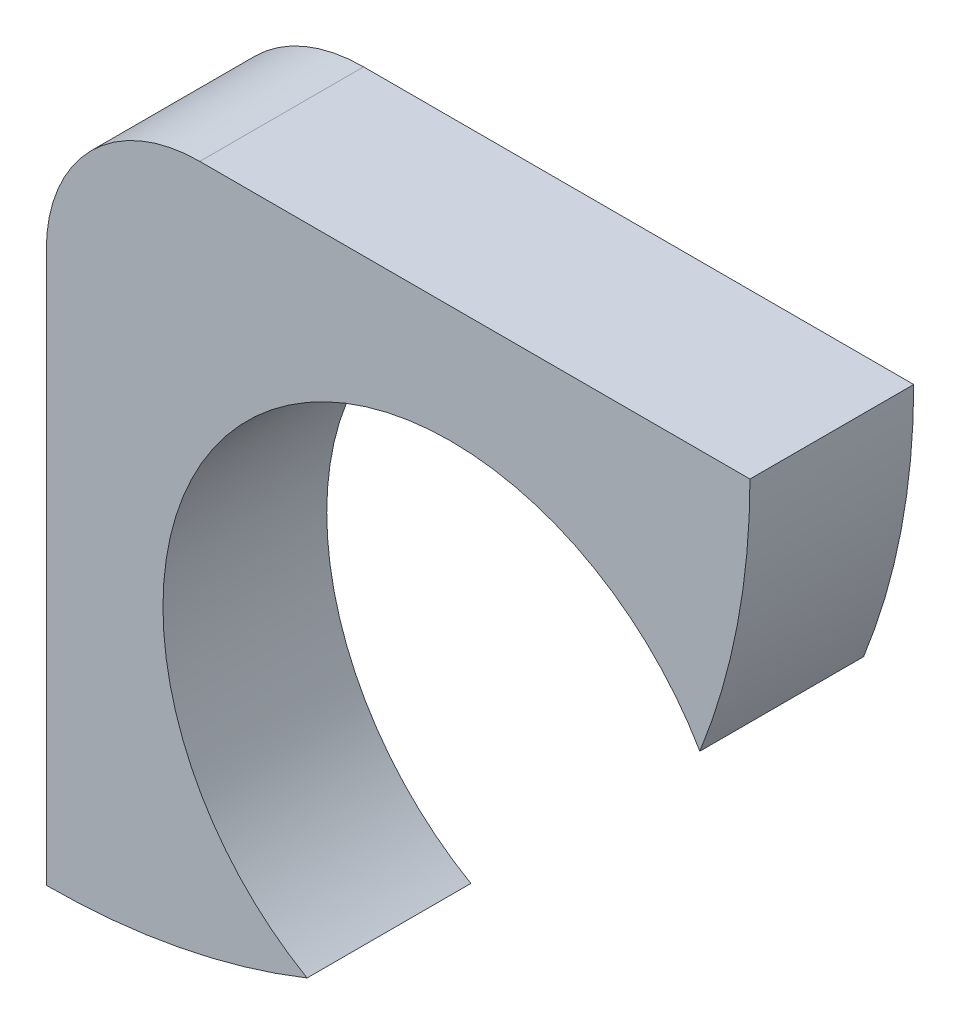
ISO-10303-21;
HEADER;
FILE_DESCRIPTION(('STEP AP214'),'2;1');
FILE_NAME('part.step','',(''),(''),'','','');
FILE_SCHEMA(('AUTOMOTIVE_DESIGN { 1 0 10303 214 1 1 1 1 }'));
ENDSEC;
DATA;
#1=APPLICATION_CONTEXT('core data for automotive mechanical design processes');
#2=APPLICATION_PROTOCOL_DEFINITION('international standard','automotive_design',2000,#1);
#3=PRODUCT_CONTEXT('',#1,'mechanical');
#4=PRODUCT('Part','Part','',(#3));
#5=PRODUCT_RELATED_PRODUCT_CATEGORY('part','',(#4));
#6=PRODUCT_DEFINITION_FORMATION('','',#4);
#7=PRODUCT_DEFINITION_CONTEXT('part definition',#1,'design');
#8=PRODUCT_DEFINITION('design','',#6,#7);
#9=PRODUCT_DEFINITION_SHAPE('','',#8);
#10=(LENGTH_UNIT() NAMED_UNIT(*) SI_UNIT(.MILLI.,.METRE.));
#11=(NAMED_UNIT(*) PLANE_ANGLE_UNIT() SI_UNIT($,.RADIAN.));
#12=(NAMED_UNIT(*) SI_UNIT($,.STERADIAN.) SOLID_ANGLE_UNIT());
#13=UNCERTAINTY_MEASURE_WITH_UNIT(LENGTH_MEASURE(1.E-05),#10,'distance_accuracy_value','');
#14=(GEOMETRIC_REPRESENTATION_CONTEXT(3) GLOBAL_UNCERTAINTY_ASSIGNED_CONTEXT((#13)) GLOBAL_UNIT_ASSIGNED_CONTEXT((#10,
#11,#12)) REPRESENTATION_CONTEXT('',''));
#15=CARTESIAN_POINT('',(0.,0.,0.));
#16=DIRECTION('',(0.,0.,1.));
#17=DIRECTION('',(1.,0.,0.));
#18=AXIS2_PLACEMENT_3D('',#15,#16,#17);
#19=CARTESIAN_POINT('',(-18.45,18.45,1.));
#20=DIRECTION('',(0.,0.,-1.));
#21=DIRECTION('',(0.,-1.,0.));
#22=AXIS2_PLACEMENT_3D('',#19,#20,#21);
#23=PLANE('',#22);
#24=CARTESIAN_POINT('',(-18.45,18.45,1.));
#25=DIRECTION('',(0.,0.,-1.));
#26=DIRECTION('',(-1.,0.,0.));
#27=AXIS2_PLACEMENT_3D('',#24,#25,#26);
#28=CIRCLE('',#27,1.5);
#29=CARTESIAN_POINT('',(-19.95,18.45,1.));
#30=VERTEX_POINT('',#29);
#31=CARTESIAN_POINT('',(-18.45,19.95,1.));
#32=VERTEX_POINT('',#31);
#33=EDGE_CURVE('E155',#30,#32,#28,.T.);
#34=ORIENTED_EDGE('',*,*,#33,.F.);
#35=DIRECTION('',(0.,1.,0.));
#36=VECTOR('',#35,1.);
#37=CARTESIAN_POINT('',(-19.95,13.075,1.));
#38=LINE('',#37,#36);
#39=CARTESIAN_POINT('',(-19.95,13.075,1.));
#40=VERTEX_POINT('',#39);
#41=EDGE_CURVE('E27',#40,#30,#38,.T.);
#42=ORIENTED_EDGE('',*,*,#41,.F.);
#43=CARTESIAN_POINT('',(-19.95,19.95,1.));
#44=DIRECTION('',(0.,0.,-1.));
#45=DIRECTION('',(-1.,0.,0.));
#46=AXIS2_PLACEMENT_3D('',#43,#44,#45);
#47=CIRCLE('',#46,6.875);
#48=CARTESIAN_POINT('',(-17.4018583423997,13.5646574803851,1.));
#49=VERTEX_POINT('',#48);
#50=EDGE_CURVE('E99',#49,#40,#47,.T.);
#51=ORIENTED_EDGE('',*,*,#50,.F.);
#52=CARTESIAN_POINT('',(-16.,16.,1.));
#53=DIRECTION('',(0.,0.,1.));
#54=DIRECTION('',(-1.,0.,0.));
#55=AXIS2_PLACEMENT_3D('',#52,#53,#54);
#56=CIRCLE('',#55,2.81);
#57=CARTESIAN_POINT('',(-13.5646574803851,17.4018583423997,1.));
#58=VERTEX_POINT('',#57);
#59=EDGE_CURVE('E20',#58,#49,#56,.T.);
#60=ORIENTED_EDGE('',*,*,#59,.F.);
#61=CARTESIAN_POINT('',(-19.95,19.95,1.));
#62=DIRECTION('',(0.,0.,-1.));
#63=DIRECTION('',(-1.,0.,0.));
#64=AXIS2_PLACEMENT_3D('',#61,#62,#63);
#65=CIRCLE('',#64,6.875);
#66=CARTESIAN_POINT('',(-13.075,19.95,1.));
#67=VERTEX_POINT('',#66);
#68=EDGE_CURVE('E87',#67,#58,#65,.T.);
#69=ORIENTED_EDGE('',*,*,#68,.F.);
#70=DIRECTION('',(1.,0.,0.));
#71=VECTOR('',#70,1.);
#72=CARTESIAN_POINT('',(-18.45,19.95,1.));
#73=LINE('',#72,#71);
#74=EDGE_CURVE('E157',#32,#67,#73,.T.);
#75=ORIENTED_EDGE('',*,*,#74,.F.);
#76=EDGE_LOOP('',(#34,#42,#51,#60,#69,#75));
#77=FACE_BOUND('',#76,.T.);
#78=ADVANCED_FACE('F16',(#77),#23,.F.);
#79=CARTESIAN_POINT('',(-18.45,18.45,-0.6));
#80=DIRECTION('',(0.,0.,-1.));
#81=DIRECTION('',(0.,-1.,0.));
#82=AXIS2_PLACEMENT_3D('',#79,#80,#81);
#83=PLANE('',#82);
#84=CARTESIAN_POINT('',(-18.45,18.45,-0.6));
#85=DIRECTION('',(0.,0.,-1.));
#86=DIRECTION('',(-1.,0.,0.));
#87=AXIS2_PLACEMENT_3D('',#84,#85,#86);
#88=CIRCLE('',#87,1.5);
#89=CARTESIAN_POINT('',(-19.95,18.45,-0.6));
#90=VERTEX_POINT('',#89);
#91=CARTESIAN_POINT('',(-18.45,19.95,-0.6));
#92=VERTEX_POINT('',#91);
#93=EDGE_CURVE('E129',#90,#92,#88,.T.);
#94=ORIENTED_EDGE('',*,*,#93,.T.);
#95=DIRECTION('',(1.,0.,0.));
#96=VECTOR('',#95,1.);
#97=CARTESIAN_POINT('',(-18.45,19.95,-0.6));
#98=LINE('',#97,#96);
#99=CARTESIAN_POINT('',(-13.075,19.95,-0.6));
#100=VERTEX_POINT('',#99);
#101=EDGE_CURVE('E133',#92,#100,#98,.T.);
#102=ORIENTED_EDGE('',*,*,#101,.T.);
#103=CARTESIAN_POINT('',(-19.95,19.95,-0.6));
#104=DIRECTION('',(0.,0.,-1.));
#105=DIRECTION('',(-1.,0.,0.));
#106=AXIS2_PLACEMENT_3D('',#103,#104,#105);
#107=CIRCLE('',#106,6.875);
#108=CARTESIAN_POINT('',(-13.5646574803851,17.4018583423997,-0.6));
#109=VERTEX_POINT('',#108);
#110=EDGE_CURVE('E80',#100,#109,#107,.T.);
#111=ORIENTED_EDGE('',*,*,#110,.T.);
#112=CARTESIAN_POINT('',(-16.,16.,-0.6));
#113=DIRECTION('',(0.,0.,1.));
#114=DIRECTION('',(-1.,0.,0.));
#115=AXIS2_PLACEMENT_3D('',#112,#113,#114);
#116=CIRCLE('',#115,2.81);
#117=CARTESIAN_POINT('',(-17.4018583423997,13.5646574803851,-0.6));
#118=VERTEX_POINT('',#117);
#119=EDGE_CURVE('E113',#109,#118,#116,.T.);
#120=ORIENTED_EDGE('',*,*,#119,.T.);
#121=CARTESIAN_POINT('',(-19.95,19.95,-0.6));
#122=DIRECTION('',(0.,0.,-1.));
#123=DIRECTION('',(-1.,0.,0.));
#124=AXIS2_PLACEMENT_3D('',#121,#122,#123);
#125=CIRCLE('',#124,6.875);
#126=CARTESIAN_POINT('',(-19.95,13.075,-0.6));
#127=VERTEX_POINT('',#126);
#128=EDGE_CURVE('E104',#118,#127,#125,.T.);
#129=ORIENTED_EDGE('',*,*,#128,.T.);
#130=DIRECTION('',(0.,1.,0.));
#131=VECTOR('',#130,1.);
#132=CARTESIAN_POINT('',(-19.95,13.075,-0.6));
#133=LINE('',#132,#131);
#134=EDGE_CURVE('E11',#127,#90,#133,.T.);
#135=ORIENTED_EDGE('',*,*,#134,.T.);
#136=EDGE_LOOP('',(#94,#102,#111,#120,#129,#135));
#137=FACE_BOUND('',#136,.T.);
#138=ADVANCED_FACE('F114',(#137),#83,.T.);
#139=CARTESIAN_POINT('',(-19.95,13.075,-0.6));
#140=DIRECTION('',(1.,0.,0.));
#141=DIRECTION('',(0.,1.,0.));
#142=AXIS2_PLACEMENT_3D('',#139,#140,#141);
#143=PLANE('',#142);
#144=ORIENTED_EDGE('',*,*,#41,.T.);
#145=DIRECTION('',(0.,0.,1.));
#146=VECTOR('',#145,1.);
#147=CARTESIAN_POINT('',(-19.95,18.45,-0.6));
#148=LINE('',#147,#146);
#149=EDGE_CURVE('E132',#90,#30,#148,.T.);
#150=ORIENTED_EDGE('',*,*,#149,.F.);
#151=ORIENTED_EDGE('',*,*,#134,.F.);
#152=DIRECTION('',(0.,0.,1.));
#153=VECTOR('',#152,1.);
#154=CARTESIAN_POINT('',(-19.95,13.075,-0.6));
#155=LINE('',#154,#153);
#156=EDGE_CURVE('E110',#127,#40,#155,.T.);
#157=ORIENTED_EDGE('',*,*,#156,.T.);
#158=EDGE_LOOP('',(#144,#150,#151,#157));
#159=FACE_BOUND('',#158,.T.);
#160=ADVANCED_FACE('F148',(#159),#143,.F.);
#161=CARTESIAN_POINT('',(-19.95,19.95,-0.6));
#162=DIRECTION('',(0.,0.,1.));
#163=DIRECTION('',(1.,0.,0.));
#164=AXIS2_PLACEMENT_3D('',#161,#162,#163);
#165=CYLINDRICAL_SURFACE('',#164,6.875);
#166=ORIENTED_EDGE('',*,*,#50,.T.);
#167=ORIENTED_EDGE('',*,*,#156,.F.);
#168=ORIENTED_EDGE('',*,*,#128,.F.);
#169=DIRECTION('',(0.,0.,1.));
#170=VECTOR('',#169,1.);
#171=CARTESIAN_POINT('',(-17.4018583423997,13.5646574803851,-0.6));
#172=LINE('',#171,#170);
#173=EDGE_CURVE('E108',#118,#49,#172,.T.);
#174=ORIENTED_EDGE('',*,*,#173,.T.);
#175=EDGE_LOOP('',(#166,#167,#168,#174));
#176=FACE_BOUND('',#175,.T.);
#177=ADVANCED_FACE('F106',(#176),#165,.T.);
#178=CARTESIAN_POINT('',(-16.,16.,-0.6));
#179=DIRECTION('',(0.,0.,1.));
#180=DIRECTION('',(1.,0.,0.));
#181=AXIS2_PLACEMENT_3D('',#178,#179,#180);
#182=CYLINDRICAL_SURFACE('',#181,2.81);
#183=ORIENTED_EDGE('',*,*,#59,.T.);
#184=ORIENTED_EDGE('',*,*,#173,.F.);
#185=ORIENTED_EDGE('',*,*,#119,.F.);
#186=DIRECTION('',(0.,0.,1.));
#187=VECTOR('',#186,1.);
#188=CARTESIAN_POINT('',(-13.5646574803851,17.4018583423997,-0.6));
#189=LINE('',#188,#187);
#190=EDGE_CURVE('E139',#109,#58,#189,.T.);
#191=ORIENTED_EDGE('',*,*,#190,.T.);
#192=EDGE_LOOP('',(#183,#184,#185,#191));
#193=FACE_BOUND('',#192,.T.);
#194=ADVANCED_FACE('F18',(#193),#182,.F.);
#195=CARTESIAN_POINT('',(-19.95,19.95,-0.6));
#196=DIRECTION('',(0.,0.,1.));
#197=DIRECTION('',(1.,0.,0.));
#198=AXIS2_PLACEMENT_3D('',#195,#196,#197);
#199=CYLINDRICAL_SURFACE('',#198,6.875);
#200=ORIENTED_EDGE('',*,*,#68,.T.);
#201=ORIENTED_EDGE('',*,*,#190,.F.);
#202=ORIENTED_EDGE('',*,*,#110,.F.);
#203=DIRECTION('',(0.,0.,1.));
#204=VECTOR('',#203,1.);
#205=CARTESIAN_POINT('',(-13.075,19.95,-0.6));
#206=LINE('',#205,#204);
#207=EDGE_CURVE('E135',#100,#67,#206,.T.);
#208=ORIENTED_EDGE('',*,*,#207,.T.);
#209=EDGE_LOOP('',(#200,#201,#202,#208));
#210=FACE_BOUND('',#209,.T.);
#211=ADVANCED_FACE('F331',(#210),#199,.T.);
#212=CARTESIAN_POINT('',(-18.45,19.95,-0.6));
#213=DIRECTION('',(0.,-1.,0.));
#214=DIRECTION('',(0.,0.,-1.));
#215=AXIS2_PLACEMENT_3D('',#212,#213,#214);
#216=PLANE('',#215);
#217=ORIENTED_EDGE('',*,*,#74,.T.);
#218=ORIENTED_EDGE('',*,*,#207,.F.);
#219=ORIENTED_EDGE('',*,*,#101,.F.);
#220=DIRECTION('',(0.,0.,1.));
#221=VECTOR('',#220,1.);
#222=CARTESIAN_POINT('',(-18.45,19.95,-0.6));
#223=LINE('',#222,#221);
#224=EDGE_CURVE('E127',#92,#32,#223,.T.);
#225=ORIENTED_EDGE('',*,*,#224,.T.);
#226=EDGE_LOOP('',(#217,#218,#219,#225));
#227=FACE_BOUND('',#226,.T.);
#228=ADVANCED_FACE('F320',(#227),#216,.F.);
#229=CARTESIAN_POINT('',(-18.45,18.45,-0.6));
#230=DIRECTION('',(0.,0.,1.));
#231=DIRECTION('',(1.,0.,0.));
#232=AXIS2_PLACEMENT_3D('',#229,#230,#231);
#233=CYLINDRICAL_SURFACE('',#232,1.5);
#234=ORIENTED_EDGE('',*,*,#33,.T.);
#235=ORIENTED_EDGE('',*,*,#224,.F.);
#236=ORIENTED_EDGE('',*,*,#93,.F.);
#237=ORIENTED_EDGE('',*,*,#149,.T.);
#238=EDGE_LOOP('',(#234,#235,#236,#237));
#239=FACE_BOUND('',#238,.T.);
#240=ADVANCED_FACE('F153',(#239),#233,.T.);
#241=CLOSED_SHELL('',(#78,#138,#160,#177,#194,#211,#228,#240));
#242=MANIFOLD_SOLID_BREP('B1',#241);
#243=ADVANCED_BREP_SHAPE_REPRESENTATION('',(#18,#242),#14);
#244=SHAPE_DEFINITION_REPRESENTATION(#9,#243);
ENDSEC;
END-ISO-10303-21;
